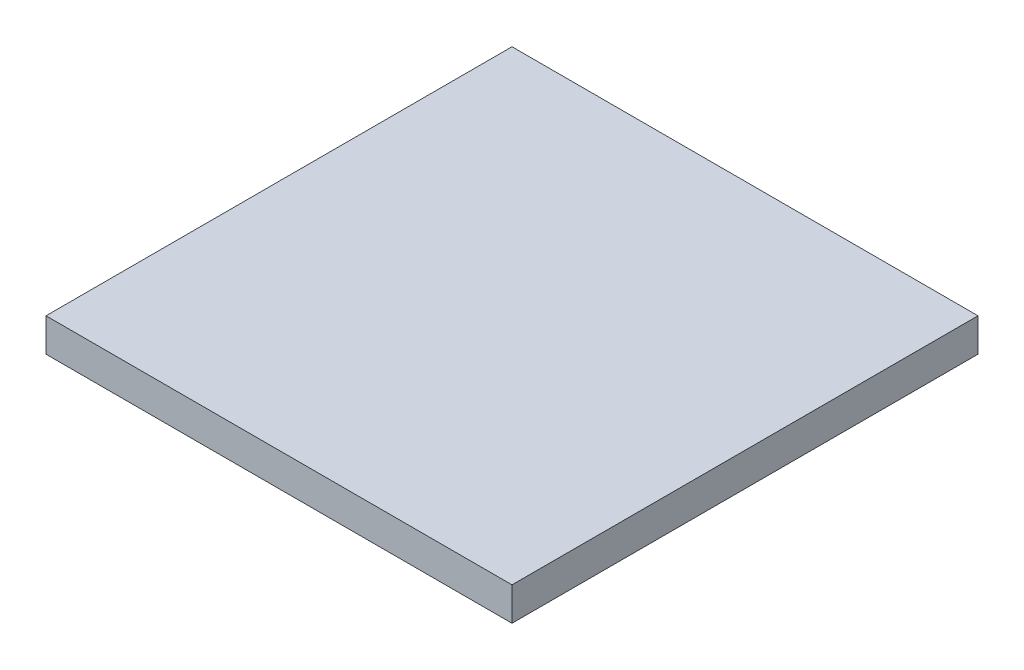
ISO-10303-21;
HEADER;
FILE_DESCRIPTION(('STEP AP214'),'2;1');
FILE_NAME('part.step','',(''),(''),'','','');
FILE_SCHEMA(('AUTOMOTIVE_DESIGN { 1 0 10303 214 1 1 1 1 }'));
ENDSEC;
DATA;
#1=APPLICATION_CONTEXT('core data for automotive mechanical design processes');
#2=APPLICATION_PROTOCOL_DEFINITION('international standard','automotive_design',2000,#1);
#3=PRODUCT_CONTEXT('',#1,'mechanical');
#4=PRODUCT('Part','Part','',(#3));
#5=PRODUCT_RELATED_PRODUCT_CATEGORY('part','',(#4));
#6=PRODUCT_DEFINITION_FORMATION('','',#4);
#7=PRODUCT_DEFINITION_CONTEXT('part definition',#1,'design');
#8=PRODUCT_DEFINITION('design','',#6,#7);
#9=PRODUCT_DEFINITION_SHAPE('','',#8);
#10=(LENGTH_UNIT() NAMED_UNIT(*) SI_UNIT(.MILLI.,.METRE.));
#11=(NAMED_UNIT(*) PLANE_ANGLE_UNIT() SI_UNIT($,.RADIAN.));
#12=(NAMED_UNIT(*) SI_UNIT($,.STERADIAN.) SOLID_ANGLE_UNIT());
#13=UNCERTAINTY_MEASURE_WITH_UNIT(LENGTH_MEASURE(1.E-05),#10,'distance_accuracy_value','');
#14=(GEOMETRIC_REPRESENTATION_CONTEXT(3) GLOBAL_UNCERTAINTY_ASSIGNED_CONTEXT((#13)) GLOBAL_UNIT_ASSIGNED_CONTEXT((#10,
#11,#12)) REPRESENTATION_CONTEXT('',''));
#15=CARTESIAN_POINT('',(0.,0.,0.));
#16=DIRECTION('',(0.,0.,1.));
#17=DIRECTION('',(1.,0.,0.));
#18=AXIS2_PLACEMENT_3D('',#15,#16,#17);
#19=CARTESIAN_POINT('',(0.,1.,0.));
#20=DIRECTION('',(0.,1.,0.));
#21=DIRECTION('',(1.,0.,0.));
#22=AXIS2_PLACEMENT_3D('',#19,#20,#21);
#23=PLANE('',#22);
#24=DIRECTION('',(1.,0.,0.));
#25=VECTOR('',#24,1.);
#26=CARTESIAN_POINT('',(0.,1.,7.));
#27=LINE('',#26,#25);
#28=CARTESIAN_POINT('',(-7.,1.,7.));
#29=VERTEX_POINT('',#28);
#30=CARTESIAN_POINT('',(7.,1.,7.));
#31=VERTEX_POINT('',#30);
#32=EDGE_CURVE('E11',#29,#31,#27,.T.);
#33=ORIENTED_EDGE('',*,*,#32,.T.);
#34=DIRECTION('',(0.,0.,-1.));
#35=VECTOR('',#34,1.);
#36=CARTESIAN_POINT('',(7.,1.,0.));
#37=LINE('',#36,#35);
#38=CARTESIAN_POINT('',(7.,1.,-7.));
#39=VERTEX_POINT('',#38);
#40=EDGE_CURVE('E27',#31,#39,#37,.T.);
#41=ORIENTED_EDGE('',*,*,#40,.T.);
#42=DIRECTION('',(-1.,0.,0.));
#43=VECTOR('',#42,1.);
#44=CARTESIAN_POINT('',(0.,1.,-7.));
#45=LINE('',#44,#43);
#46=CARTESIAN_POINT('',(-7.,1.,-7.));
#47=VERTEX_POINT('',#46);
#48=EDGE_CURVE('E81',#39,#47,#45,.T.);
#49=ORIENTED_EDGE('',*,*,#48,.T.);
#50=DIRECTION('',(0.,0.,1.));
#51=VECTOR('',#50,1.);
#52=CARTESIAN_POINT('',(-7.,1.,0.));
#53=LINE('',#52,#51);
#54=EDGE_CURVE('E68',#47,#29,#53,.T.);
#55=ORIENTED_EDGE('',*,*,#54,.T.);
#56=EDGE_LOOP('',(#33,#41,#49,#55));
#57=FACE_BOUND('',#56,.T.);
#58=ADVANCED_FACE('F17',(#57),#23,.T.);
#59=CARTESIAN_POINT('',(7.,0.,7.));
#60=DIRECTION('',(1.,0.,0.));
#61=DIRECTION('',(0.,1.,0.));
#62=AXIS2_PLACEMENT_3D('',#59,#60,#61);
#63=PLANE('',#62);
#64=DIRECTION('',(0.,0.,-1.));
#65=VECTOR('',#64,1.);
#66=CARTESIAN_POINT('',(7.,0.,7.));
#67=LINE('',#66,#65);
#68=CARTESIAN_POINT('',(7.,0.,7.));
#69=VERTEX_POINT('',#68);
#70=CARTESIAN_POINT('',(7.,0.,-7.));
#71=VERTEX_POINT('',#70);
#72=EDGE_CURVE('E82',#69,#71,#67,.T.);
#73=ORIENTED_EDGE('',*,*,#72,.T.);
#74=DIRECTION('',(0.,1.,0.));
#75=VECTOR('',#74,1.);
#76=CARTESIAN_POINT('',(7.,0.,-7.));
#77=LINE('',#76,#75);
#78=EDGE_CURVE('E110',#71,#39,#77,.T.);
#79=ORIENTED_EDGE('',*,*,#78,.T.);
#80=ORIENTED_EDGE('',*,*,#40,.F.);
#81=DIRECTION('',(0.,-1.,0.));
#82=VECTOR('',#81,1.);
#83=CARTESIAN_POINT('',(7.,0.,7.));
#84=LINE('',#83,#82);
#85=EDGE_CURVE('E107',#31,#69,#84,.T.);
#86=ORIENTED_EDGE('',*,*,#85,.T.);
#87=EDGE_LOOP('',(#73,#79,#80,#86));
#88=FACE_BOUND('',#87,.T.);
#89=ADVANCED_FACE('F192',(#88),#63,.T.);
#90=CARTESIAN_POINT('',(-7.,0.,7.));
#91=DIRECTION('',(0.,0.,1.));
#92=DIRECTION('',(1.,0.,0.));
#93=AXIS2_PLACEMENT_3D('',#90,#91,#92);
#94=PLANE('',#93);
#95=DIRECTION('',(1.,0.,0.));
#96=VECTOR('',#95,1.);
#97=CARTESIAN_POINT('',(-7.,0.,7.));
#98=LINE('',#97,#96);
#99=CARTESIAN_POINT('',(-7.,0.,7.));
#100=VERTEX_POINT('',#99);
#101=EDGE_CURVE('E111',#100,#69,#98,.T.);
#102=ORIENTED_EDGE('',*,*,#101,.T.);
#103=ORIENTED_EDGE('',*,*,#85,.F.);
#104=ORIENTED_EDGE('',*,*,#32,.F.);
#105=DIRECTION('',(0.,-1.,0.));
#106=VECTOR('',#105,1.);
#107=CARTESIAN_POINT('',(-7.,0.,7.));
#108=LINE('',#107,#106);
#109=EDGE_CURVE('E79',#29,#100,#108,.T.);
#110=ORIENTED_EDGE('',*,*,#109,.T.);
#111=EDGE_LOOP('',(#102,#103,#104,#110));
#112=FACE_BOUND('',#111,.T.);
#113=ADVANCED_FACE('F184',(#112),#94,.T.);
#114=CARTESIAN_POINT('',(-7.,0.,-7.));
#115=DIRECTION('',(-1.,0.,0.));
#116=DIRECTION('',(0.,0.,1.));
#117=AXIS2_PLACEMENT_3D('',#114,#115,#116);
#118=PLANE('',#117);
#119=DIRECTION('',(0.,0.,1.));
#120=VECTOR('',#119,1.);
#121=CARTESIAN_POINT('',(-7.,0.,-7.));
#122=LINE('',#121,#120);
#123=CARTESIAN_POINT('',(-7.,0.,-7.));
#124=VERTEX_POINT('',#123);
#125=EDGE_CURVE('E92',#124,#100,#122,.T.);
#126=ORIENTED_EDGE('',*,*,#125,.T.);
#127=ORIENTED_EDGE('',*,*,#109,.F.);
#128=ORIENTED_EDGE('',*,*,#54,.F.);
#129=DIRECTION('',(0.,-1.,0.));
#130=VECTOR('',#129,1.);
#131=CARTESIAN_POINT('',(-7.,0.,-7.));
#132=LINE('',#131,#130);
#133=EDGE_CURVE('E20',#47,#124,#132,.T.);
#134=ORIENTED_EDGE('',*,*,#133,.T.);
#135=EDGE_LOOP('',(#126,#127,#128,#134));
#136=FACE_BOUND('',#135,.T.);
#137=ADVANCED_FACE('F76',(#136),#118,.T.);
#138=CARTESIAN_POINT('',(7.,0.,-7.));
#139=DIRECTION('',(0.,0.,-1.));
#140=DIRECTION('',(-1.,0.,0.));
#141=AXIS2_PLACEMENT_3D('',#138,#139,#140);
#142=PLANE('',#141);
#143=DIRECTION('',(-1.,0.,0.));
#144=VECTOR('',#143,1.);
#145=CARTESIAN_POINT('',(7.,0.,-7.));
#146=LINE('',#145,#144);
#147=EDGE_CURVE('E90',#71,#124,#146,.T.);
#148=ORIENTED_EDGE('',*,*,#147,.T.);
#149=ORIENTED_EDGE('',*,*,#133,.F.);
#150=ORIENTED_EDGE('',*,*,#48,.F.);
#151=ORIENTED_EDGE('',*,*,#78,.F.);
#152=EDGE_LOOP('',(#148,#149,#150,#151));
#153=FACE_BOUND('',#152,.T.);
#154=ADVANCED_FACE('F88',(#153),#142,.T.);
#155=CARTESIAN_POINT('',(0.,0.,0.));
#156=DIRECTION('',(0.,1.,0.));
#157=DIRECTION('',(1.,0.,0.));
#158=AXIS2_PLACEMENT_3D('',#155,#156,#157);
#159=PLANE('',#158);
#160=ORIENTED_EDGE('',*,*,#147,.F.);
#161=ORIENTED_EDGE('',*,*,#72,.F.);
#162=ORIENTED_EDGE('',*,*,#101,.F.);
#163=ORIENTED_EDGE('',*,*,#125,.F.);
#164=EDGE_LOOP('',(#160,#161,#162,#163));
#165=FACE_BOUND('',#164,.T.);
#166=ADVANCED_FACE('F157',(#165),#159,.F.);
#167=CLOSED_SHELL('',(#58,#89,#113,#137,#154,#166));
#168=MANIFOLD_SOLID_BREP('B1',#167);
#169=ADVANCED_BREP_SHAPE_REPRESENTATION('',(#18,#168),#14);
#170=SHAPE_DEFINITION_REPRESENTATION(#9,#169);
ENDSEC;
END-ISO-10303-21;
